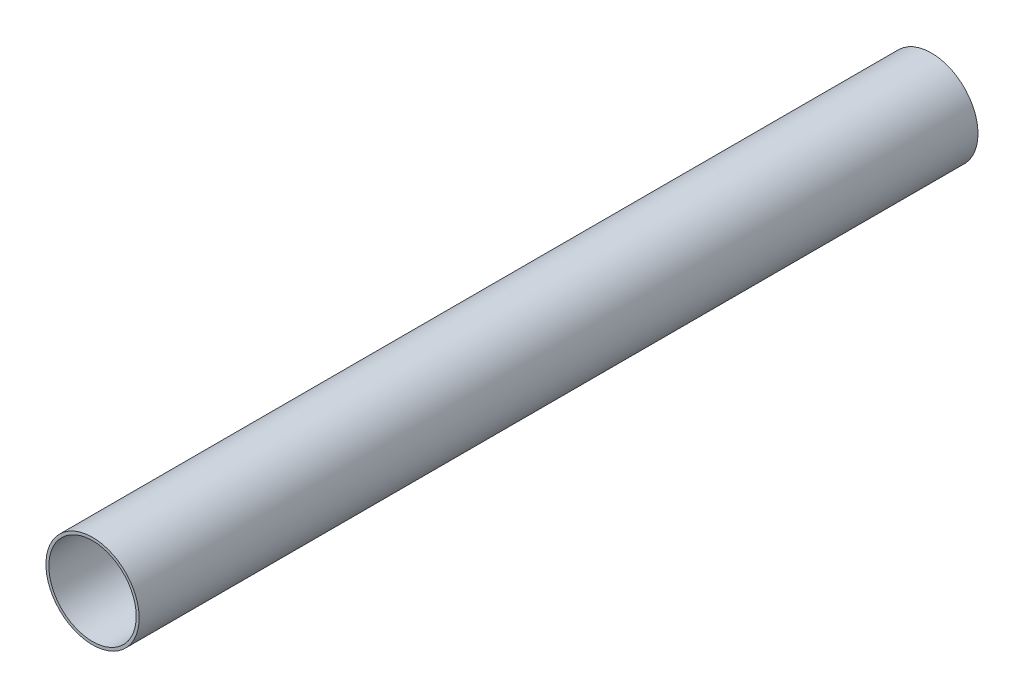
ISO-10303-21;
HEADER;
FILE_DESCRIPTION(('STEP AP214'),'2;1');
FILE_NAME('part.step','',(''),(''),'','','');
FILE_SCHEMA(('AUTOMOTIVE_DESIGN { 1 0 10303 214 1 1 1 1 }'));
ENDSEC;
DATA;
#1=APPLICATION_CONTEXT('core data for automotive mechanical design processes');
#2=APPLICATION_PROTOCOL_DEFINITION('international standard','automotive_design',2000,#1);
#3=PRODUCT_CONTEXT('',#1,'mechanical');
#4=PRODUCT('Part','Part','',(#3));
#5=PRODUCT_RELATED_PRODUCT_CATEGORY('part','',(#4));
#6=PRODUCT_DEFINITION_FORMATION('','',#4);
#7=PRODUCT_DEFINITION_CONTEXT('part definition',#1,'design');
#8=PRODUCT_DEFINITION('design','',#6,#7);
#9=PRODUCT_DEFINITION_SHAPE('','',#8);
#10=(LENGTH_UNIT() NAMED_UNIT(*) SI_UNIT(.MILLI.,.METRE.));
#11=(NAMED_UNIT(*) PLANE_ANGLE_UNIT() SI_UNIT($,.RADIAN.));
#12=(NAMED_UNIT(*) SI_UNIT($,.STERADIAN.) SOLID_ANGLE_UNIT());
#13=UNCERTAINTY_MEASURE_WITH_UNIT(LENGTH_MEASURE(1.E-05),#10,'distance_accuracy_value','');
#14=(GEOMETRIC_REPRESENTATION_CONTEXT(3) GLOBAL_UNCERTAINTY_ASSIGNED_CONTEXT((#13)) GLOBAL_UNIT_ASSIGNED_CONTEXT((#10,
#11,#12)) REPRESENTATION_CONTEXT('',''));
#15=CARTESIAN_POINT('',(0.,0.,0.));
#16=DIRECTION('',(0.,0.,1.));
#17=DIRECTION('',(1.,0.,0.));
#18=AXIS2_PLACEMENT_3D('',#15,#16,#17);
#19=CARTESIAN_POINT('',(0.,0.,5486.4));
#20=DIRECTION('',(0.,0.,1.));
#21=DIRECTION('',(1.,0.,0.));
#22=AXIS2_PLACEMENT_3D('',#19,#20,#21);
#23=PLANE('',#22);
#24=CARTESIAN_POINT('',(0.,0.,5486.4));
#25=DIRECTION('',(0.,0.,1.));
#26=DIRECTION('',(1.,0.,0.));
#27=AXIS2_PLACEMENT_3D('',#24,#25,#26);
#28=CIRCLE('',#27,304.8);
#29=CARTESIAN_POINT('',(304.8,0.,5486.4));
#30=VERTEX_POINT('',#29);
#31=EDGE_CURVE('E10',#30,#30,#28,.T.);
#32=ORIENTED_EDGE('',*,*,#31,.T.);
#33=EDGE_LOOP('',(#32));
#34=FACE_BOUND('',#33,.T.);
#35=CARTESIAN_POINT('',(0.,0.,5486.4));
#36=DIRECTION('',(0.,0.,1.));
#37=DIRECTION('',(1.,0.,0.));
#38=AXIS2_PLACEMENT_3D('',#35,#36,#37);
#39=CIRCLE('',#38,285.75);
#40=CARTESIAN_POINT('',(285.75,0.,5486.4));
#41=VERTEX_POINT('',#40);
#42=EDGE_CURVE('E39',#41,#41,#39,.T.);
#43=ORIENTED_EDGE('',*,*,#42,.F.);
#44=EDGE_LOOP('',(#43));
#45=FACE_BOUND('',#44,.T.);
#46=ADVANCED_FACE('F28',(#34,#45),#23,.T.);
#47=CARTESIAN_POINT('',(0.,0.,0.));
#48=DIRECTION('',(0.,0.,1.));
#49=DIRECTION('',(1.,0.,0.));
#50=AXIS2_PLACEMENT_3D('',#47,#48,#49);
#51=PLANE('',#50);
#52=CARTESIAN_POINT('',(0.,0.,0.));
#53=DIRECTION('',(0.,0.,1.));
#54=DIRECTION('',(1.,0.,0.));
#55=AXIS2_PLACEMENT_3D('',#52,#53,#54);
#56=CIRCLE('',#55,304.8);
#57=CARTESIAN_POINT('',(304.8,0.,0.));
#58=VERTEX_POINT('',#57);
#59=EDGE_CURVE('E32',#58,#58,#56,.T.);
#60=ORIENTED_EDGE('',*,*,#59,.F.);
#61=EDGE_LOOP('',(#60));
#62=FACE_BOUND('',#61,.T.);
#63=CARTESIAN_POINT('',(0.,0.,0.));
#64=DIRECTION('',(0.,0.,1.));
#65=DIRECTION('',(1.,0.,0.));
#66=AXIS2_PLACEMENT_3D('',#63,#64,#65);
#67=CIRCLE('',#66,285.75);
#68=CARTESIAN_POINT('',(285.75,0.,0.));
#69=VERTEX_POINT('',#68);
#70=EDGE_CURVE('E41',#69,#69,#67,.T.);
#71=ORIENTED_EDGE('',*,*,#70,.T.);
#72=EDGE_LOOP('',(#71));
#73=FACE_BOUND('',#72,.T.);
#74=ADVANCED_FACE('F51',(#62,#73),#51,.F.);
#75=CARTESIAN_POINT('',(0.,0.,5486.4));
#76=DIRECTION('',(0.,0.,-1.));
#77=DIRECTION('',(-1.,0.,0.));
#78=AXIS2_PLACEMENT_3D('',#75,#76,#77);
#79=CYLINDRICAL_SURFACE('',#78,304.8);
#80=ORIENTED_EDGE('',*,*,#31,.F.);
#81=EDGE_LOOP('',(#80));
#82=FACE_BOUND('',#81,.T.);
#83=ORIENTED_EDGE('',*,*,#59,.T.);
#84=EDGE_LOOP('',(#83));
#85=FACE_BOUND('',#84,.T.);
#86=ADVANCED_FACE('F30',(#82,#85),#79,.T.);
#87=CARTESIAN_POINT('',(0.,0.,5486.4));
#88=DIRECTION('',(0.,0.,-1.));
#89=DIRECTION('',(-1.,0.,0.));
#90=AXIS2_PLACEMENT_3D('',#87,#88,#89);
#91=CYLINDRICAL_SURFACE('',#90,285.75);
#92=ORIENTED_EDGE('',*,*,#42,.T.);
#93=EDGE_LOOP('',(#92));
#94=FACE_BOUND('',#93,.T.);
#95=ORIENTED_EDGE('',*,*,#70,.F.);
#96=EDGE_LOOP('',(#95));
#97=FACE_BOUND('',#96,.T.);
#98=ADVANCED_FACE('F47',(#94,#97),#91,.F.);
#99=CLOSED_SHELL('',(#46,#74,#86,#98));
#100=MANIFOLD_SOLID_BREP('B2',#99);
#101=ADVANCED_BREP_SHAPE_REPRESENTATION('',(#18,#100),#14);
#102=SHAPE_DEFINITION_REPRESENTATION(#9,#101);
ENDSEC;
END-ISO-10303-21;
